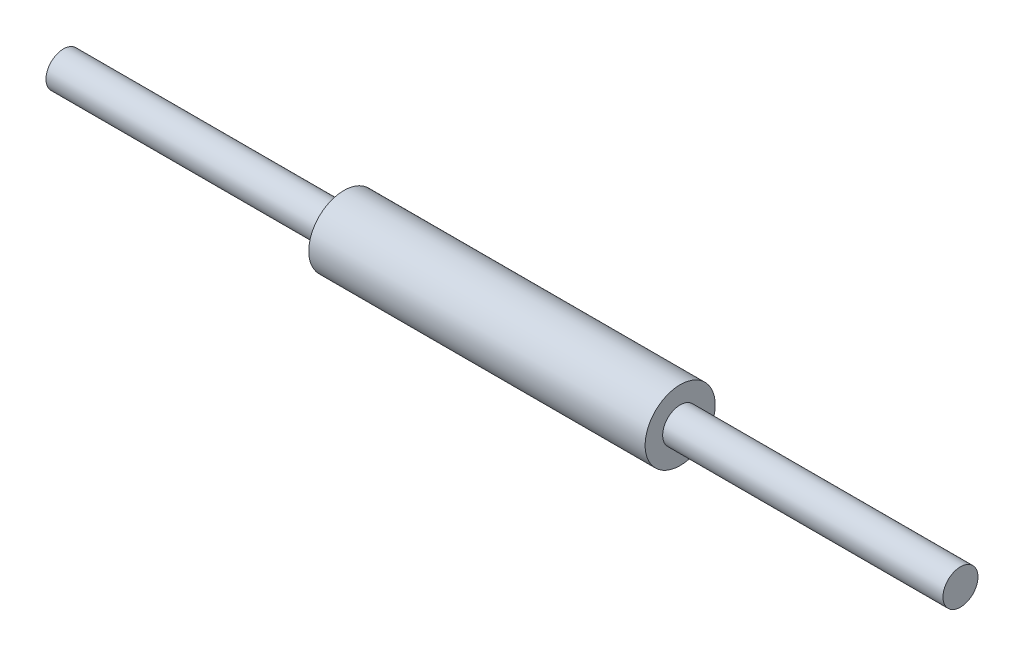
ISO-10303-21;
HEADER;
FILE_DESCRIPTION(('STEP AP214'),'2;1');
FILE_NAME('part.step','',(''),(''),'','','');
FILE_SCHEMA(('AUTOMOTIVE_DESIGN { 1 0 10303 214 1 1 1 1 }'));
ENDSEC;
DATA;
#1=APPLICATION_CONTEXT('core data for automotive mechanical design processes');
#2=APPLICATION_PROTOCOL_DEFINITION('international standard','automotive_design',2000,#1);
#3=PRODUCT_CONTEXT('',#1,'mechanical');
#4=PRODUCT('Part','Part','',(#3));
#5=PRODUCT_RELATED_PRODUCT_CATEGORY('part','',(#4));
#6=PRODUCT_DEFINITION_FORMATION('','',#4);
#7=PRODUCT_DEFINITION_CONTEXT('part definition',#1,'design');
#8=PRODUCT_DEFINITION('design','',#6,#7);
#9=PRODUCT_DEFINITION_SHAPE('','',#8);
#10=(LENGTH_UNIT() NAMED_UNIT(*) SI_UNIT(.MILLI.,.METRE.));
#11=(NAMED_UNIT(*) PLANE_ANGLE_UNIT() SI_UNIT($,.RADIAN.));
#12=(NAMED_UNIT(*) SI_UNIT($,.STERADIAN.) SOLID_ANGLE_UNIT());
#13=UNCERTAINTY_MEASURE_WITH_UNIT(LENGTH_MEASURE(1.E-05),#10,'distance_accuracy_value','');
#14=(GEOMETRIC_REPRESENTATION_CONTEXT(3) GLOBAL_UNCERTAINTY_ASSIGNED_CONTEXT((#13)) GLOBAL_UNIT_ASSIGNED_CONTEXT((#10,
#11,#12)) REPRESENTATION_CONTEXT('',''));
#15=CARTESIAN_POINT('',(0.,0.,0.));
#16=DIRECTION('',(0.,0.,1.));
#17=DIRECTION('',(1.,0.,0.));
#18=AXIS2_PLACEMENT_3D('',#15,#16,#17);
#19=CARTESIAN_POINT('',(640.,0.,0.));
#20=DIRECTION('',(-1.,0.,0.));
#21=DIRECTION('',(0.,0.,1.));
#22=AXIS2_PLACEMENT_3D('',#19,#20,#21);
#23=CYLINDRICAL_SURFACE('',#22,12.5);
#24=CARTESIAN_POINT('',(640.,0.,0.));
#25=DIRECTION('',(1.,0.,0.));
#26=DIRECTION('',(0.,0.,-1.));
#27=AXIS2_PLACEMENT_3D('',#24,#25,#26);
#28=CIRCLE('',#27,12.5);
#29=CARTESIAN_POINT('',(640.,0.,-12.5));
#30=VERTEX_POINT('',#29);
#31=EDGE_CURVE('E11',#30,#30,#28,.T.);
#32=ORIENTED_EDGE('',*,*,#31,.F.);
#33=EDGE_LOOP('',(#32));
#34=FACE_BOUND('',#33,.T.);
#35=CARTESIAN_POINT('',(440.,0.,0.));
#36=DIRECTION('',(1.,0.,0.));
#37=DIRECTION('',(0.,0.,-1.));
#38=AXIS2_PLACEMENT_3D('',#35,#36,#37);
#39=CIRCLE('',#38,12.5);
#40=CARTESIAN_POINT('',(440.,0.,-12.5));
#41=VERTEX_POINT('',#40);
#42=EDGE_CURVE('E49',#41,#41,#39,.T.);
#43=ORIENTED_EDGE('',*,*,#42,.T.);
#44=EDGE_LOOP('',(#43));
#45=FACE_BOUND('',#44,.T.);
#46=ADVANCED_FACE('F46',(#34,#45),#23,.T.);
#47=CARTESIAN_POINT('',(640.,0.,0.));
#48=DIRECTION('',(1.,0.,0.));
#49=DIRECTION('',(0.,0.,-1.));
#50=AXIS2_PLACEMENT_3D('',#47,#48,#49);
#51=PLANE('',#50);
#52=ORIENTED_EDGE('',*,*,#31,.T.);
#53=EDGE_LOOP('',(#52));
#54=FACE_BOUND('',#53,.T.);
#55=ADVANCED_FACE('F61',(#54),#51,.T.);
#56=CARTESIAN_POINT('',(440.,0.,0.));
#57=DIRECTION('',(1.,0.,0.));
#58=DIRECTION('',(0.,0.,-1.));
#59=AXIS2_PLACEMENT_3D('',#56,#57,#58);
#60=PLANE('',#59);
#61=ORIENTED_EDGE('',*,*,#42,.F.);
#62=EDGE_LOOP('',(#61));
#63=FACE_BOUND('',#62,.T.);
#64=ADVANCED_FACE('F59',(#63),#60,.F.);
#65=CLOSED_SHELL('',(#46,#55,#64));
#66=MANIFOLD_SOLID_BREP('B2',#65);
#67=CARTESIAN_POINT('',(440.,0.,0.));
#68=DIRECTION('',(-1.,0.,0.));
#69=DIRECTION('',(0.,0.,1.));
#70=AXIS2_PLACEMENT_3D('',#67,#68,#69);
#71=CYLINDRICAL_SURFACE('',#70,25.);
#72=CARTESIAN_POINT('',(440.,0.,0.));
#73=DIRECTION('',(1.,0.,0.));
#74=DIRECTION('',(0.,0.,-1.));
#75=AXIS2_PLACEMENT_3D('',#72,#73,#74);
#76=CIRCLE('',#75,25.);
#77=CARTESIAN_POINT('',(440.,0.,-25.));
#78=VERTEX_POINT('',#77);
#79=EDGE_CURVE('E45',#78,#78,#76,.T.);
#80=ORIENTED_EDGE('',*,*,#79,.F.);
#81=EDGE_LOOP('',(#80));
#82=FACE_BOUND('',#81,.T.);
#83=CARTESIAN_POINT('',(200.,0.,0.));
#84=DIRECTION('',(1.,0.,0.));
#85=DIRECTION('',(0.,0.,-1.));
#86=AXIS2_PLACEMENT_3D('',#83,#84,#85);
#87=CIRCLE('',#86,25.);
#88=CARTESIAN_POINT('',(200.,0.,-25.));
#89=VERTEX_POINT('',#88);
#90=EDGE_CURVE('E97',#89,#89,#87,.T.);
#91=ORIENTED_EDGE('',*,*,#90,.T.);
#92=EDGE_LOOP('',(#91));
#93=FACE_BOUND('',#92,.T.);
#94=ADVANCED_FACE('F94',(#82,#93),#71,.T.);
#95=CARTESIAN_POINT('',(440.,0.,0.));
#96=DIRECTION('',(1.,0.,0.));
#97=DIRECTION('',(0.,0.,-1.));
#98=AXIS2_PLACEMENT_3D('',#95,#96,#97);
#99=PLANE('',#98);
#100=ORIENTED_EDGE('',*,*,#79,.T.);
#101=EDGE_LOOP('',(#100));
#102=FACE_BOUND('',#101,.T.);
#103=ADVANCED_FACE('F109',(#102),#99,.T.);
#104=CARTESIAN_POINT('',(200.,0.,0.));
#105=DIRECTION('',(1.,0.,0.));
#106=DIRECTION('',(0.,0.,-1.));
#107=AXIS2_PLACEMENT_3D('',#104,#105,#106);
#108=PLANE('',#107);
#109=ORIENTED_EDGE('',*,*,#90,.F.);
#110=EDGE_LOOP('',(#109));
#111=FACE_BOUND('',#110,.T.);
#112=ADVANCED_FACE('F107',(#111),#108,.F.);
#113=CLOSED_SHELL('',(#94,#103,#112));
#114=MANIFOLD_SOLID_BREP('B6',#113);
#115=CARTESIAN_POINT('',(200.,0.,0.));
#116=DIRECTION('',(-1.,0.,0.));
#117=DIRECTION('',(0.,0.,1.));
#118=AXIS2_PLACEMENT_3D('',#115,#116,#117);
#119=CYLINDRICAL_SURFACE('',#118,12.5);
#120=CARTESIAN_POINT('',(200.,0.,0.));
#121=DIRECTION('',(1.,0.,0.));
#122=DIRECTION('',(0.,0.,-1.));
#123=AXIS2_PLACEMENT_3D('',#120,#121,#122);
#124=CIRCLE('',#123,12.5);
#125=CARTESIAN_POINT('',(200.,0.,-12.5));
#126=VERTEX_POINT('',#125);
#127=EDGE_CURVE('E93',#126,#126,#124,.T.);
#128=ORIENTED_EDGE('',*,*,#127,.F.);
#129=EDGE_LOOP('',(#128));
#130=FACE_BOUND('',#129,.T.);
#131=CARTESIAN_POINT('',(0.,0.,0.));
#132=DIRECTION('',(1.,0.,0.));
#133=DIRECTION('',(0.,0.,-1.));
#134=AXIS2_PLACEMENT_3D('',#131,#132,#133);
#135=CIRCLE('',#134,12.5);
#136=CARTESIAN_POINT('',(0.,0.,-12.5));
#137=VERTEX_POINT('',#136);
#138=EDGE_CURVE('E138',#137,#137,#135,.T.);
#139=ORIENTED_EDGE('',*,*,#138,.T.);
#140=EDGE_LOOP('',(#139));
#141=FACE_BOUND('',#140,.T.);
#142=ADVANCED_FACE('F135',(#130,#141),#119,.T.);
#143=CARTESIAN_POINT('',(200.,0.,0.));
#144=DIRECTION('',(1.,0.,0.));
#145=DIRECTION('',(0.,0.,-1.));
#146=AXIS2_PLACEMENT_3D('',#143,#144,#145);
#147=PLANE('',#146);
#148=ORIENTED_EDGE('',*,*,#127,.T.);
#149=EDGE_LOOP('',(#148));
#150=FACE_BOUND('',#149,.T.);
#151=ADVANCED_FACE('F150',(#150),#147,.T.);
#152=CARTESIAN_POINT('',(0.,0.,0.));
#153=DIRECTION('',(1.,0.,0.));
#154=DIRECTION('',(0.,0.,-1.));
#155=AXIS2_PLACEMENT_3D('',#152,#153,#154);
#156=PLANE('',#155);
#157=ORIENTED_EDGE('',*,*,#138,.F.);
#158=EDGE_LOOP('',(#157));
#159=FACE_BOUND('',#158,.T.);
#160=ADVANCED_FACE('F148',(#159),#156,.F.);
#161=CLOSED_SHELL('',(#142,#151,#160));
#162=MANIFOLD_SOLID_BREP('B40',#161);
#163=ADVANCED_BREP_SHAPE_REPRESENTATION('',(#18,#66,#114,#162),#14);
#164=SHAPE_DEFINITION_REPRESENTATION(#9,#163);
ENDSEC;
END-ISO-10303-21;
